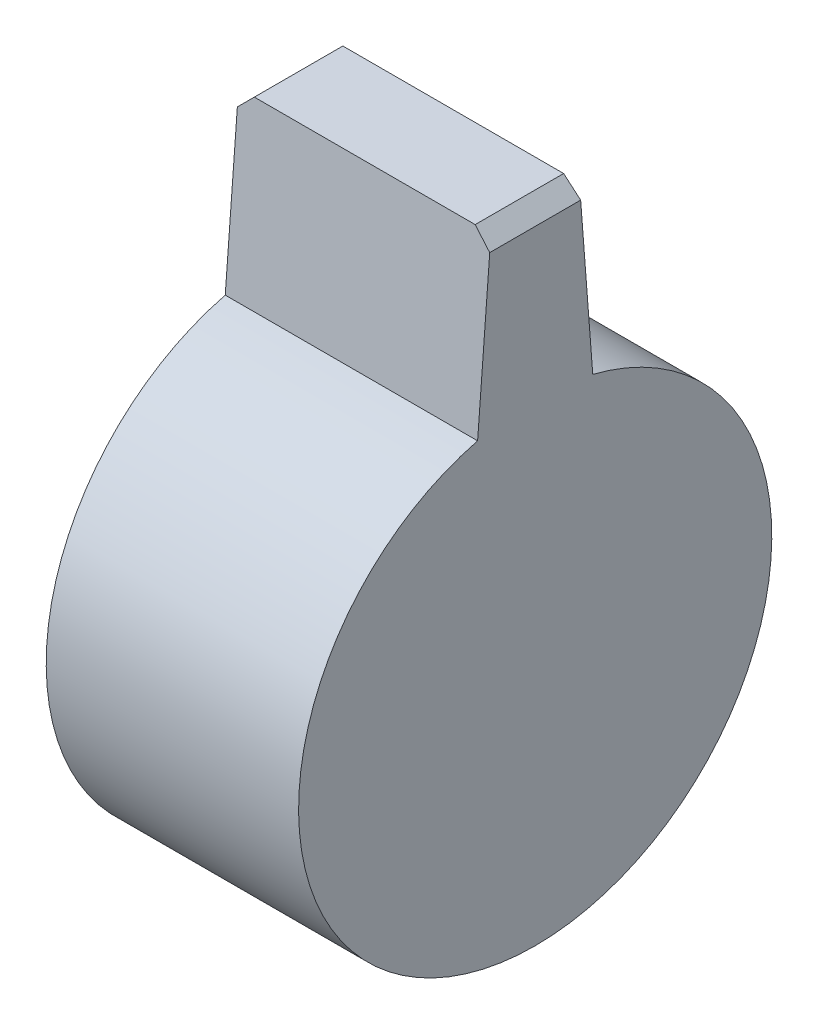
ISO-10303-21;
HEADER;
FILE_DESCRIPTION(('STEP AP214'),'2;1');
FILE_NAME('part.step','',(''),(''),'','','');
FILE_SCHEMA(('AUTOMOTIVE_DESIGN { 1 0 10303 214 1 1 1 1 }'));
ENDSEC;
DATA;
#1=APPLICATION_CONTEXT('core data for automotive mechanical design processes');
#2=APPLICATION_PROTOCOL_DEFINITION('international standard','automotive_design',2000,#1);
#3=PRODUCT_CONTEXT('',#1,'mechanical');
#4=PRODUCT('Part','Part','',(#3));
#5=PRODUCT_RELATED_PRODUCT_CATEGORY('part','',(#4));
#6=PRODUCT_DEFINITION_FORMATION('','',#4);
#7=PRODUCT_DEFINITION_CONTEXT('part definition',#1,'design');
#8=PRODUCT_DEFINITION('design','',#6,#7);
#9=PRODUCT_DEFINITION_SHAPE('','',#8);
#10=(LENGTH_UNIT() NAMED_UNIT(*) SI_UNIT(.MILLI.,.METRE.));
#11=(NAMED_UNIT(*) PLANE_ANGLE_UNIT() SI_UNIT($,.RADIAN.));
#12=(NAMED_UNIT(*) SI_UNIT($,.STERADIAN.) SOLID_ANGLE_UNIT());
#13=UNCERTAINTY_MEASURE_WITH_UNIT(LENGTH_MEASURE(1.E-05),#10,'distance_accuracy_value','');
#14=(GEOMETRIC_REPRESENTATION_CONTEXT(3) GLOBAL_UNCERTAINTY_ASSIGNED_CONTEXT((#13)) GLOBAL_UNIT_ASSIGNED_CONTEXT((#10,
#11,#12)) REPRESENTATION_CONTEXT('',''));
#15=CARTESIAN_POINT('',(0.,0.,0.));
#16=DIRECTION('',(0.,0.,1.));
#17=DIRECTION('',(1.,0.,0.));
#18=AXIS2_PLACEMENT_3D('',#15,#16,#17);
#19=CARTESIAN_POINT('',(16.,14.5491408681063,3.65));
#20=DIRECTION('',(0.,0.0769341980906743,0.997036172445185));
#21=DIRECTION('',(0.,-0.997036172445185,0.0769341980906743));
#22=AXIS2_PLACEMENT_3D('',#19,#20,#21);
#23=PLANE('',#22);
#24=DIRECTION('',(0.,0.997036172445185,-0.0769341980906743));
#25=VECTOR('',#24,1.);
#26=CARTESIAN_POINT('',(16.,14.5491408681063,3.65));
#27=LINE('',#26,#25);
#28=CARTESIAN_POINT('',(16.,14.5491408681063,3.65));
#29=VERTEX_POINT('',#28);
#30=CARTESIAN_POINT('',(16.,24.5,2.88216289560688));
#31=VERTEX_POINT('',#30);
#32=EDGE_CURVE('E104',#29,#31,#27,.T.);
#33=ORIENTED_EDGE('',*,*,#32,.T.);
#34=DIRECTION('',(0.706056577169155,-0.706056577169155,0.0544813699566568));
#35=VECTOR('',#34,1.);
#36=CARTESIAN_POINT('',(20.9901977338629,19.5098022661371,3.26722100240265));
#37=LINE('',#36,#35);
#38=CARTESIAN_POINT('',(15.,25.5,2.805));
#39=VERTEX_POINT('',#38);
#40=EDGE_CURVE('E46',#31,#39,#37,.F.);
#41=ORIENTED_EDGE('',*,*,#40,.T.);
#42=DIRECTION('',(-1.,0.,0.));
#43=VECTOR('',#42,1.);
#44=CARTESIAN_POINT('',(16.,25.5,2.805));
#45=LINE('',#44,#43);
#46=CARTESIAN_POINT('',(1.,25.5,2.805));
#47=VERTEX_POINT('',#46);
#48=EDGE_CURVE('E109',#39,#47,#45,.T.);
#49=ORIENTED_EDGE('',*,*,#48,.T.);
#50=DIRECTION('',(-0.706056577169155,-0.706056577169155,0.0544813699566568));
#51=VECTOR('',#50,1.);
#52=CARTESIAN_POINT('',(2.98605650875824,27.4860565087582,2.65175012894532));
#53=LINE('',#52,#51);
#54=CARTESIAN_POINT('',(0.,24.5,2.88216289560688));
#55=VERTEX_POINT('',#54);
#56=EDGE_CURVE('E53',#47,#55,#53,.T.);
#57=ORIENTED_EDGE('',*,*,#56,.T.);
#58=DIRECTION('',(0.,0.997036172445185,-0.0769341980906743));
#59=VECTOR('',#58,1.);
#60=CARTESIAN_POINT('',(0.,14.5491408681063,3.65));
#61=LINE('',#60,#59);
#62=CARTESIAN_POINT('',(0.,14.5491408681063,3.65));
#63=VERTEX_POINT('',#62);
#64=EDGE_CURVE('E210',#63,#55,#61,.T.);
#65=ORIENTED_EDGE('',*,*,#64,.F.);
#66=DIRECTION('',(-1.,0.,0.));
#67=VECTOR('',#66,1.);
#68=CARTESIAN_POINT('',(16.,14.5491408681063,3.65));
#69=LINE('',#68,#67);
#70=EDGE_CURVE('E114',#29,#63,#69,.T.);
#71=ORIENTED_EDGE('',*,*,#70,.F.);
#72=EDGE_LOOP('',(#33,#41,#49,#57,#65,#71));
#73=FACE_BOUND('',#72,.T.);
#74=ADVANCED_FACE('F37',(#73),#23,.T.);
#75=CARTESIAN_POINT('',(16.,0.,0.));
#76=DIRECTION('',(-1.,0.,0.));
#77=DIRECTION('',(0.,0.,1.));
#78=AXIS2_PLACEMENT_3D('',#75,#76,#77);
#79=CYLINDRICAL_SURFACE('',#78,15.);
#80=CARTESIAN_POINT('',(0.,0.,0.));
#81=DIRECTION('',(1.,0.,0.));
#82=DIRECTION('',(0.,0.,-1.));
#83=AXIS2_PLACEMENT_3D('',#80,#81,#82);
#84=CIRCLE('',#83,15.);
#85=CARTESIAN_POINT('',(0.,14.5491408681063,-3.65));
#86=VERTEX_POINT('',#85);
#87=EDGE_CURVE('E113',#63,#86,#84,.T.);
#88=ORIENTED_EDGE('',*,*,#87,.T.);
#89=DIRECTION('',(-1.,0.,0.));
#90=VECTOR('',#89,1.);
#91=CARTESIAN_POINT('',(16.,14.5491408681063,-3.65));
#92=LINE('',#91,#90);
#93=CARTESIAN_POINT('',(16.,14.5491408681063,-3.65));
#94=VERTEX_POINT('',#93);
#95=EDGE_CURVE('E100',#94,#86,#92,.T.);
#96=ORIENTED_EDGE('',*,*,#95,.F.);
#97=CARTESIAN_POINT('',(16.,0.,0.));
#98=DIRECTION('',(1.,0.,0.));
#99=DIRECTION('',(0.,0.,-1.));
#100=AXIS2_PLACEMENT_3D('',#97,#98,#99);
#101=CIRCLE('',#100,15.);
#102=EDGE_CURVE('E103',#29,#94,#101,.T.);
#103=ORIENTED_EDGE('',*,*,#102,.F.);
#104=ORIENTED_EDGE('',*,*,#70,.T.);
#105=EDGE_LOOP('',(#88,#96,#103,#104));
#106=FACE_BOUND('',#105,.T.);
#107=ADVANCED_FACE('F111',(#106),#79,.T.);
#108=CARTESIAN_POINT('',(16.,25.5,-2.805));
#109=DIRECTION('',(0.,0.0769341980906742,-0.997036172445185));
#110=DIRECTION('',(0.,0.997036172445185,0.0769341980906742));
#111=AXIS2_PLACEMENT_3D('',#108,#109,#110);
#112=PLANE('',#111);
#113=DIRECTION('',(-1.,0.,0.));
#114=VECTOR('',#113,1.);
#115=CARTESIAN_POINT('',(16.,25.5,-2.805));
#116=LINE('',#115,#114);
#117=CARTESIAN_POINT('',(15.,25.5,-2.805));
#118=VERTEX_POINT('',#117);
#119=CARTESIAN_POINT('',(1.,25.5,-2.805));
#120=VERTEX_POINT('',#119);
#121=EDGE_CURVE('E115',#118,#120,#116,.T.);
#122=ORIENTED_EDGE('',*,*,#121,.F.);
#123=DIRECTION('',(-0.706056577169155,0.706056577169155,0.0544813699566568));
#124=VECTOR('',#123,1.);
#125=CARTESIAN_POINT('',(15.4985158901638,25.0014841098362,-2.84346692959108));
#126=LINE('',#125,#124);
#127=CARTESIAN_POINT('',(16.,24.5,-2.88216289560688));
#128=VERTEX_POINT('',#127);
#129=EDGE_CURVE('E102',#118,#128,#126,.F.);
#130=ORIENTED_EDGE('',*,*,#129,.T.);
#131=DIRECTION('',(0.,-0.997036172445185,-0.0769341980906742));
#132=VECTOR('',#131,1.);
#133=CARTESIAN_POINT('',(16.,25.5,-2.805));
#134=LINE('',#133,#132);
#135=EDGE_CURVE('E94',#128,#94,#134,.T.);
#136=ORIENTED_EDGE('',*,*,#135,.T.);
#137=ORIENTED_EDGE('',*,*,#95,.T.);
#138=DIRECTION('',(0.,-0.997036172445185,-0.0769341980906742));
#139=VECTOR('',#138,1.);
#140=CARTESIAN_POINT('',(0.,25.5,-2.805));
#141=LINE('',#140,#139);
#142=CARTESIAN_POINT('',(0.,24.5,-2.88216289560688));
#143=VERTEX_POINT('',#142);
#144=EDGE_CURVE('E212',#143,#86,#141,.T.);
#145=ORIENTED_EDGE('',*,*,#144,.F.);
#146=DIRECTION('',(0.706056577169155,0.706056577169155,0.0544813699566568));
#147=VECTOR('',#146,1.);
#148=CARTESIAN_POINT('',(8.47773835245734,32.9777383524573,-2.22799605613375));
#149=LINE('',#148,#147);
#150=EDGE_CURVE('E128',#143,#120,#149,.T.);
#151=ORIENTED_EDGE('',*,*,#150,.T.);
#152=EDGE_LOOP('',(#122,#130,#136,#137,#145,#151));
#153=FACE_BOUND('',#152,.T.);
#154=ADVANCED_FACE('F97',(#153),#112,.T.);
#155=CARTESIAN_POINT('',(16.,25.5,2.805));
#156=DIRECTION('',(0.,1.,0.));
#157=DIRECTION('',(0.,0.,1.));
#158=AXIS2_PLACEMENT_3D('',#155,#156,#157);
#159=PLANE('',#158);
#160=ORIENTED_EDGE('',*,*,#48,.F.);
#161=DIRECTION('',(0.,0.,-1.));
#162=VECTOR('',#161,1.);
#163=CARTESIAN_POINT('',(15.,25.5,2.805));
#164=LINE('',#163,#162);
#165=EDGE_CURVE('E125',#39,#118,#164,.T.);
#166=ORIENTED_EDGE('',*,*,#165,.T.);
#167=ORIENTED_EDGE('',*,*,#121,.T.);
#168=DIRECTION('',(0.,0.,1.));
#169=VECTOR('',#168,1.);
#170=CARTESIAN_POINT('',(1.,25.5,2.805));
#171=LINE('',#170,#169);
#172=EDGE_CURVE('E117',#120,#47,#171,.T.);
#173=ORIENTED_EDGE('',*,*,#172,.T.);
#174=EDGE_LOOP('',(#160,#166,#167,#173));
#175=FACE_BOUND('',#174,.T.);
#176=ADVANCED_FACE('F137',(#175),#159,.T.);
#177=CARTESIAN_POINT('',(16.,0.,0.));
#178=DIRECTION('',(1.,0.,0.));
#179=DIRECTION('',(0.,0.,-1.));
#180=AXIS2_PLACEMENT_3D('',#177,#178,#179);
#181=PLANE('',#180);
#182=ORIENTED_EDGE('',*,*,#135,.F.);
#183=DIRECTION('',(0.,0.,1.));
#184=VECTOR('',#183,1.);
#185=CARTESIAN_POINT('',(16.,24.5,0.));
#186=LINE('',#185,#184);
#187=EDGE_CURVE('E61',#128,#31,#186,.T.);
#188=ORIENTED_EDGE('',*,*,#187,.T.);
#189=ORIENTED_EDGE('',*,*,#32,.F.);
#190=ORIENTED_EDGE('',*,*,#102,.T.);
#191=EDGE_LOOP('',(#182,#188,#189,#190));
#192=FACE_BOUND('',#191,.T.);
#193=ADVANCED_FACE('F107',(#192),#181,.T.);
#194=CARTESIAN_POINT('',(0.,0.,0.));
#195=DIRECTION('',(1.,0.,0.));
#196=DIRECTION('',(0.,0.,-1.));
#197=AXIS2_PLACEMENT_3D('',#194,#195,#196);
#198=PLANE('',#197);
#199=ORIENTED_EDGE('',*,*,#64,.T.);
#200=DIRECTION('',(0.,0.,-1.));
#201=VECTOR('',#200,1.);
#202=CARTESIAN_POINT('',(0.,24.5,-2.805));
#203=LINE('',#202,#201);
#204=EDGE_CURVE('E11',#55,#143,#203,.T.);
#205=ORIENTED_EDGE('',*,*,#204,.T.);
#206=ORIENTED_EDGE('',*,*,#144,.T.);
#207=ORIENTED_EDGE('',*,*,#87,.F.);
#208=EDGE_LOOP('',(#199,#205,#206,#207));
#209=FACE_BOUND('',#208,.T.);
#210=ADVANCED_FACE('F141',(#209),#198,.F.);
#211=CARTESIAN_POINT('',(15.,25.5,2.805));
#212=DIRECTION('',(-0.707106781186547,-0.707106781186547,0.));
#213=DIRECTION('',(0.,0.,-1.));
#214=AXIS2_PLACEMENT_3D('',#211,#212,#213);
#215=PLANE('',#214);
#216=ORIENTED_EDGE('',*,*,#40,.F.);
#217=ORIENTED_EDGE('',*,*,#187,.F.);
#218=ORIENTED_EDGE('',*,*,#129,.F.);
#219=ORIENTED_EDGE('',*,*,#165,.F.);
#220=EDGE_LOOP('',(#216,#217,#218,#219));
#221=FACE_BOUND('',#220,.T.);
#222=ADVANCED_FACE('F139',(#221),#215,.F.);
#223=CARTESIAN_POINT('',(0.,24.5,0.));
#224=DIRECTION('',(-0.707106781186547,0.707106781186547,0.));
#225=DIRECTION('',(0.,0.,1.));
#226=AXIS2_PLACEMENT_3D('',#223,#224,#225);
#227=PLANE('',#226);
#228=ORIENTED_EDGE('',*,*,#56,.F.);
#229=ORIENTED_EDGE('',*,*,#172,.F.);
#230=ORIENTED_EDGE('',*,*,#150,.F.);
#231=ORIENTED_EDGE('',*,*,#204,.F.);
#232=EDGE_LOOP('',(#228,#229,#230,#231));
#233=FACE_BOUND('',#232,.T.);
#234=ADVANCED_FACE('F40',(#233),#227,.T.);
#235=CLOSED_SHELL('',(#74,#107,#154,#176,#193,#210,#222,#234));
#236=MANIFOLD_SOLID_BREP('B2',#235);
#237=ADVANCED_BREP_SHAPE_REPRESENTATION('',(#18,#236),#14);
#238=SHAPE_DEFINITION_REPRESENTATION(#9,#237);
ENDSEC;
END-ISO-10303-21;
